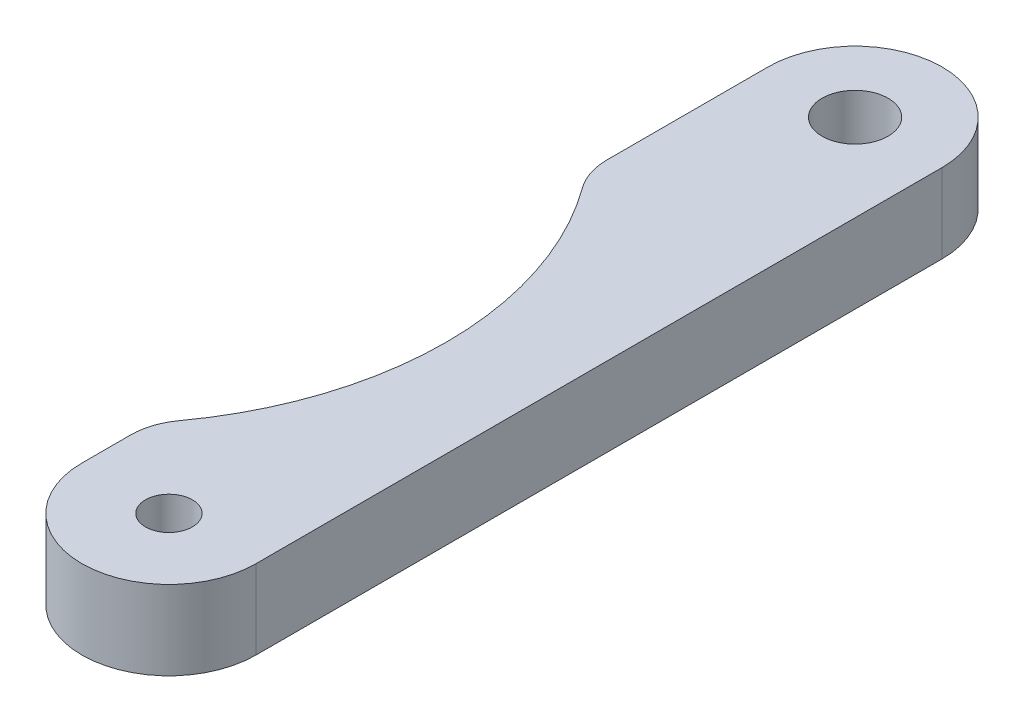
ISO-10303-21;
HEADER;
FILE_DESCRIPTION(('STEP AP214'),'2;1');
FILE_NAME('part.step','',(''),(''),'','','');
FILE_SCHEMA(('AUTOMOTIVE_DESIGN { 1 0 10303 214 1 1 1 1 }'));
ENDSEC;
DATA;
#1=APPLICATION_CONTEXT('core data for automotive mechanical design processes');
#2=APPLICATION_PROTOCOL_DEFINITION('international standard','automotive_design',2000,#1);
#3=PRODUCT_CONTEXT('',#1,'mechanical');
#4=PRODUCT('Part','Part','',(#3));
#5=PRODUCT_RELATED_PRODUCT_CATEGORY('part','',(#4));
#6=PRODUCT_DEFINITION_FORMATION('','',#4);
#7=PRODUCT_DEFINITION_CONTEXT('part definition',#1,'design');
#8=PRODUCT_DEFINITION('design','',#6,#7);
#9=PRODUCT_DEFINITION_SHAPE('','',#8);
#10=(LENGTH_UNIT() NAMED_UNIT(*) SI_UNIT(.MILLI.,.METRE.));
#11=(NAMED_UNIT(*) PLANE_ANGLE_UNIT() SI_UNIT($,.RADIAN.));
#12=(NAMED_UNIT(*) SI_UNIT($,.STERADIAN.) SOLID_ANGLE_UNIT());
#13=UNCERTAINTY_MEASURE_WITH_UNIT(LENGTH_MEASURE(1.E-05),#10,'distance_accuracy_value','');
#14=(GEOMETRIC_REPRESENTATION_CONTEXT(3) GLOBAL_UNCERTAINTY_ASSIGNED_CONTEXT((#13)) GLOBAL_UNIT_ASSIGNED_CONTEXT((#10,
#11,#12)) REPRESENTATION_CONTEXT('',''));
#15=CARTESIAN_POINT('',(0.,0.,0.));
#16=DIRECTION('',(0.,0.,1.));
#17=DIRECTION('',(1.,0.,0.));
#18=AXIS2_PLACEMENT_3D('',#15,#16,#17);
#19=CARTESIAN_POINT('',(0.30765517241379,3.81,-6.51724137931036));
#20=DIRECTION('',(1.,0.,0.));
#21=DIRECTION('',(0.,0.,-1.));
#22=AXIS2_PLACEMENT_3D('',#19,#20,#21);
#23=PLANE('',#22);
#24=DIRECTION('',(0.,0.,1.));
#25=VECTOR('',#24,1.);
#26=CARTESIAN_POINT('',(0.30765517241379,3.81,-6.51724137931036));
#27=LINE('',#26,#25);
#28=CARTESIAN_POINT('',(0.307655172413794,3.81,24.1582715009935));
#29=VERTEX_POINT('',#28);
#30=CARTESIAN_POINT('',(0.307655172413794,3.81,26.5027586206896));
#31=VERTEX_POINT('',#30);
#32=EDGE_CURVE('E114',#29,#31,#27,.T.);
#33=ORIENTED_EDGE('',*,*,#32,.F.);
#34=DIRECTION('',(0.,1.,0.));
#35=VECTOR('',#34,1.);
#36=CARTESIAN_POINT('',(0.307655172413794,0.,24.1582715009935));
#37=LINE('',#36,#35);
#38=CARTESIAN_POINT('',(0.307655172413794,0.,24.1582715009935));
#39=VERTEX_POINT('',#38);
#40=EDGE_CURVE('E62',#29,#39,#37,.F.);
#41=ORIENTED_EDGE('',*,*,#40,.T.);
#42=DIRECTION('',(0.,0.,1.));
#43=VECTOR('',#42,1.);
#44=CARTESIAN_POINT('',(0.30765517241379,0.,-6.51724137931036));
#45=LINE('',#44,#43);
#46=CARTESIAN_POINT('',(0.307655172413794,0.,26.5027586206896));
#47=VERTEX_POINT('',#46);
#48=EDGE_CURVE('E155',#39,#47,#45,.T.);
#49=ORIENTED_EDGE('',*,*,#48,.T.);
#50=DIRECTION('',(0.,-1.,0.));
#51=VECTOR('',#50,1.);
#52=CARTESIAN_POINT('',(0.307655172413794,3.81,26.5027586206896));
#53=LINE('',#52,#51);
#54=EDGE_CURVE('E132',#31,#47,#53,.T.);
#55=ORIENTED_EDGE('',*,*,#54,.F.);
#56=EDGE_LOOP('',(#33,#41,#49,#55));
#57=FACE_BOUND('',#56,.T.);
#58=ADVANCED_FACE('F39',(#57),#23,.F.);
#59=CARTESIAN_POINT('',(0.30765517241379,0.,-6.51724137931036));
#60=VERTEX_POINT('',#59);
#61=CARTESIAN_POINT('',(0.307655172413791,0.,1.22176292136022));
#62=VERTEX_POINT('',#61);
#63=EDGE_CURVE('E173',#60,#62,#45,.T.);
#64=ORIENTED_EDGE('',*,*,#63,.T.);
#65=DIRECTION('',(0.,1.,0.));
#66=VECTOR('',#65,1.);
#67=CARTESIAN_POINT('',(0.307655172413791,3.81,1.22176292136022));
#68=LINE('',#67,#66);
#69=CARTESIAN_POINT('',(0.307655172413791,3.81,1.22176292136022));
#70=VERTEX_POINT('',#69);
#71=EDGE_CURVE('E11',#62,#70,#68,.T.);
#72=ORIENTED_EDGE('',*,*,#71,.T.);
#73=CARTESIAN_POINT('',(0.30765517241379,3.81,-6.51724137931036));
#74=VERTEX_POINT('',#73);
#75=EDGE_CURVE('E104',#74,#70,#27,.T.);
#76=ORIENTED_EDGE('',*,*,#75,.F.);
#77=DIRECTION('',(0.,-1.,0.));
#78=VECTOR('',#77,1.);
#79=CARTESIAN_POINT('',(0.30765517241379,3.81,-6.51724137931036));
#80=LINE('',#79,#78);
#81=EDGE_CURVE('E108',#74,#60,#80,.T.);
#82=ORIENTED_EDGE('',*,*,#81,.T.);
#83=EDGE_LOOP('',(#64,#72,#76,#82));
#84=FACE_BOUND('',#83,.T.);
#85=ADVANCED_FACE('F106',(#84),#23,.F.);
#86=CARTESIAN_POINT('',(4.49865517241379,3.81,-6.51724137931036));
#87=DIRECTION('',(0.,-1.,0.));
#88=DIRECTION('',(0.,0.,-1.));
#89=AXIS2_PLACEMENT_3D('',#86,#87,#88);
#90=CYLINDRICAL_SURFACE('',#89,4.191);
#91=CARTESIAN_POINT('',(4.49865517241379,0.,-6.51724137931036));
#92=DIRECTION('',(0.,1.,0.));
#93=DIRECTION('',(0.,0.,-1.));
#94=AXIS2_PLACEMENT_3D('',#91,#92,#93);
#95=CIRCLE('',#94,4.191);
#96=CARTESIAN_POINT('',(8.68965517241379,0.,-6.51724137931035));
#97=VERTEX_POINT('',#96);
#98=EDGE_CURVE('E130',#97,#60,#95,.T.);
#99=ORIENTED_EDGE('',*,*,#98,.T.);
#100=ORIENTED_EDGE('',*,*,#81,.F.);
#101=CARTESIAN_POINT('',(4.49865517241379,3.81,-6.51724137931036));
#102=DIRECTION('',(0.,1.,0.));
#103=DIRECTION('',(0.,0.,-1.));
#104=AXIS2_PLACEMENT_3D('',#101,#102,#103);
#105=CIRCLE('',#104,4.191);
#106=CARTESIAN_POINT('',(8.68965517241379,3.81,-6.51724137931035));
#107=VERTEX_POINT('',#106);
#108=EDGE_CURVE('E117',#107,#74,#105,.T.);
#109=ORIENTED_EDGE('',*,*,#108,.F.);
#110=DIRECTION('',(0.,-1.,0.));
#111=VECTOR('',#110,1.);
#112=CARTESIAN_POINT('',(8.68965517241379,3.81,-6.51724137931035));
#113=LINE('',#112,#111);
#114=EDGE_CURVE('E170',#107,#97,#113,.T.);
#115=ORIENTED_EDGE('',*,*,#114,.T.);
#116=EDGE_LOOP('',(#99,#100,#109,#115));
#117=FACE_BOUND('',#116,.T.);
#118=ADVANCED_FACE('F128',(#117),#90,.T.);
#119=CARTESIAN_POINT('',(4.49865517241379,3.81,26.5027586206896));
#120=DIRECTION('',(0.,-1.,0.));
#121=DIRECTION('',(0.,0.,-1.));
#122=AXIS2_PLACEMENT_3D('',#119,#120,#121);
#123=CYLINDRICAL_SURFACE('',#122,4.191);
#124=CARTESIAN_POINT('',(4.49865517241379,0.,26.5027586206896));
#125=DIRECTION('',(0.,1.,0.));
#126=DIRECTION('',(0.,0.,-1.));
#127=AXIS2_PLACEMENT_3D('',#124,#125,#126);
#128=CIRCLE('',#127,4.191);
#129=CARTESIAN_POINT('',(8.6896551724138,0.,26.5027586206896));
#130=VERTEX_POINT('',#129);
#131=EDGE_CURVE('E175',#47,#130,#128,.T.);
#132=ORIENTED_EDGE('',*,*,#131,.T.);
#133=DIRECTION('',(0.,-1.,0.));
#134=VECTOR('',#133,1.);
#135=CARTESIAN_POINT('',(8.6896551724138,3.81,26.5027586206896));
#136=LINE('',#135,#134);
#137=CARTESIAN_POINT('',(8.6896551724138,3.81,26.5027586206896));
#138=VERTEX_POINT('',#137);
#139=EDGE_CURVE('E137',#138,#130,#136,.T.);
#140=ORIENTED_EDGE('',*,*,#139,.F.);
#141=CARTESIAN_POINT('',(4.49865517241379,3.81,26.5027586206896));
#142=DIRECTION('',(0.,1.,0.));
#143=DIRECTION('',(0.,0.,-1.));
#144=AXIS2_PLACEMENT_3D('',#141,#142,#143);
#145=CIRCLE('',#144,4.191);
#146=EDGE_CURVE('E113',#31,#138,#145,.T.);
#147=ORIENTED_EDGE('',*,*,#146,.F.);
#148=ORIENTED_EDGE('',*,*,#54,.T.);
#149=EDGE_LOOP('',(#132,#140,#147,#148));
#150=FACE_BOUND('',#149,.T.);
#151=ADVANCED_FACE('F212',(#150),#123,.T.);
#152=CARTESIAN_POINT('',(8.68965517241379,3.81,-6.51724137931035));
#153=DIRECTION('',(-1.,0.,0.));
#154=DIRECTION('',(0.,0.,1.));
#155=AXIS2_PLACEMENT_3D('',#152,#153,#154);
#156=PLANE('',#155);
#157=DIRECTION('',(0.,0.,-1.));
#158=VECTOR('',#157,1.);
#159=CARTESIAN_POINT('',(8.68965517241379,0.,-6.51724137931035));
#160=LINE('',#159,#158);
#161=EDGE_CURVE('E126',#130,#97,#160,.T.);
#162=ORIENTED_EDGE('',*,*,#161,.T.);
#163=ORIENTED_EDGE('',*,*,#114,.F.);
#164=DIRECTION('',(0.,0.,-1.));
#165=VECTOR('',#164,1.);
#166=CARTESIAN_POINT('',(8.68965517241379,3.81,-6.51724137931035));
#167=LINE('',#166,#165);
#168=EDGE_CURVE('E122',#138,#107,#167,.T.);
#169=ORIENTED_EDGE('',*,*,#168,.F.);
#170=ORIENTED_EDGE('',*,*,#139,.T.);
#171=EDGE_LOOP('',(#162,#163,#169,#170));
#172=FACE_BOUND('',#171,.T.);
#173=ADVANCED_FACE('F182',(#172),#156,.F.);
#174=CARTESIAN_POINT('',(4.49865517241379,3.81,-6.51724137931036));
#175=DIRECTION('',(0.,-1.,0.));
#176=DIRECTION('',(0.,0.,-1.));
#177=AXIS2_PLACEMENT_3D('',#174,#175,#176);
#178=PLANE('',#177);
#179=CARTESIAN_POINT('',(4.49865517241379,3.81,-6.51724137931035));
#180=DIRECTION('',(0.,1.,0.));
#181=DIRECTION('',(0.,0.,1.));
#182=AXIS2_PLACEMENT_3D('',#179,#180,#181);
#183=CIRCLE('',#182,1.5875);
#184=CARTESIAN_POINT('',(4.49865517241379,3.81,-4.92974137931035));
#185=VERTEX_POINT('',#184);
#186=EDGE_CURVE('E191',#185,#185,#183,.T.);
#187=ORIENTED_EDGE('',*,*,#186,.F.);
#188=EDGE_LOOP('',(#187));
#189=FACE_BOUND('',#188,.T.);
#190=CARTESIAN_POINT('',(-12.4511278879657,3.81,12.6900172111769));
#191=DIRECTION('',(0.,1.,0.));
#192=DIRECTION('',(0.,0.,1.));
#193=AXIS2_PLACEMENT_3D('',#190,#191,#192);
#194=CIRCLE('',#193,16.49);
#195=CARTESIAN_POINT('',(0.881983074869492,3.81,22.3930194297031));
#196=VERTEX_POINT('',#195);
#197=CARTESIAN_POINT('',(0.881983074869492,3.81,2.98701499265062));
#198=VERTEX_POINT('',#197);
#199=EDGE_CURVE('E164',#196,#198,#194,.T.);
#200=ORIENTED_EDGE('',*,*,#199,.F.);
#201=CARTESIAN_POINT('',(3.30765517241379,3.81,24.1582715009935));
#202=DIRECTION('',(0.,-1.,0.));
#203=DIRECTION('',(0.,0.,-1.));
#204=AXIS2_PLACEMENT_3D('',#201,#202,#203);
#205=CIRCLE('',#204,3.);
#206=EDGE_CURVE('E148',#196,#29,#205,.F.);
#207=ORIENTED_EDGE('',*,*,#206,.T.);
#208=ORIENTED_EDGE('',*,*,#32,.T.);
#209=ORIENTED_EDGE('',*,*,#146,.T.);
#210=ORIENTED_EDGE('',*,*,#168,.T.);
#211=ORIENTED_EDGE('',*,*,#108,.T.);
#212=ORIENTED_EDGE('',*,*,#75,.T.);
#213=CARTESIAN_POINT('',(3.30765517241379,3.81,1.22176292136022));
#214=DIRECTION('',(0.,-1.,0.));
#215=DIRECTION('',(0.,0.,-1.));
#216=AXIS2_PLACEMENT_3D('',#213,#214,#215);
#217=CIRCLE('',#216,3.);
#218=EDGE_CURVE('E146',#70,#198,#217,.F.);
#219=ORIENTED_EDGE('',*,*,#218,.T.);
#220=EDGE_LOOP('',(#200,#207,#208,#209,#210,#211,#212,#219));
#221=FACE_BOUND('',#220,.T.);
#222=CARTESIAN_POINT('',(4.49865517241379,3.81,26.5027586206896));
#223=DIRECTION('',(0.,1.,0.));
#224=DIRECTION('',(0.,0.,1.));
#225=AXIS2_PLACEMENT_3D('',#222,#223,#224);
#226=CIRCLE('',#225,1.1303);
#227=CARTESIAN_POINT('',(4.49865517241379,3.81,27.6330586206896));
#228=VERTEX_POINT('',#227);
#229=EDGE_CURVE('E185',#228,#228,#226,.T.);
#230=ORIENTED_EDGE('',*,*,#229,.F.);
#231=EDGE_LOOP('',(#230));
#232=FACE_BOUND('',#231,.T.);
#233=ADVANCED_FACE('F119',(#189,#221,#232),#178,.F.);
#234=CARTESIAN_POINT('',(4.49865517241379,0.,-6.51724137931036));
#235=DIRECTION('',(0.,-1.,0.));
#236=DIRECTION('',(0.,0.,-1.));
#237=AXIS2_PLACEMENT_3D('',#234,#235,#236);
#238=PLANE('',#237);
#239=CARTESIAN_POINT('',(4.49865517241379,0.,-6.51724137931035));
#240=DIRECTION('',(0.,1.,0.));
#241=DIRECTION('',(0.,0.,1.));
#242=AXIS2_PLACEMENT_3D('',#239,#240,#241);
#243=CIRCLE('',#242,1.5875);
#244=CARTESIAN_POINT('',(4.49865517241379,0.,-4.92974137931035));
#245=VERTEX_POINT('',#244);
#246=EDGE_CURVE('E186',#245,#245,#243,.T.);
#247=ORIENTED_EDGE('',*,*,#246,.T.);
#248=EDGE_LOOP('',(#247));
#249=FACE_BOUND('',#248,.T.);
#250=CARTESIAN_POINT('',(4.49865517241379,0.,26.5027586206896));
#251=DIRECTION('',(0.,1.,0.));
#252=DIRECTION('',(0.,0.,1.));
#253=AXIS2_PLACEMENT_3D('',#250,#251,#252);
#254=CIRCLE('',#253,1.1303);
#255=CARTESIAN_POINT('',(4.49865517241379,0.,27.6330586206896));
#256=VERTEX_POINT('',#255);
#257=EDGE_CURVE('E172',#256,#256,#254,.T.);
#258=ORIENTED_EDGE('',*,*,#257,.T.);
#259=EDGE_LOOP('',(#258));
#260=FACE_BOUND('',#259,.T.);
#261=ORIENTED_EDGE('',*,*,#48,.F.);
#262=CARTESIAN_POINT('',(3.30765517241379,0.,24.1582715009935));
#263=DIRECTION('',(0.,-1.,0.));
#264=DIRECTION('',(0.,0.,-1.));
#265=AXIS2_PLACEMENT_3D('',#262,#263,#264);
#266=CIRCLE('',#265,3.);
#267=CARTESIAN_POINT('',(0.881983074869492,0.,22.3930194297031));
#268=VERTEX_POINT('',#267);
#269=EDGE_CURVE('E47',#39,#268,#266,.T.);
#270=ORIENTED_EDGE('',*,*,#269,.T.);
#271=CARTESIAN_POINT('',(-12.4511278879657,0.,12.6900172111769));
#272=DIRECTION('',(0.,-1.,0.));
#273=DIRECTION('',(0.,0.,-1.));
#274=AXIS2_PLACEMENT_3D('',#271,#272,#273);
#275=CIRCLE('',#274,16.49);
#276=CARTESIAN_POINT('',(0.881983074869492,0.,2.98701499265062));
#277=VERTEX_POINT('',#276);
#278=EDGE_CURVE('E131',#268,#277,#275,.F.);
#279=ORIENTED_EDGE('',*,*,#278,.T.);
#280=CARTESIAN_POINT('',(3.30765517241379,0.,1.22176292136022));
#281=DIRECTION('',(0.,-1.,0.));
#282=DIRECTION('',(0.,0.,-1.));
#283=AXIS2_PLACEMENT_3D('',#280,#281,#282);
#284=CIRCLE('',#283,3.);
#285=EDGE_CURVE('E54',#277,#62,#284,.T.);
#286=ORIENTED_EDGE('',*,*,#285,.T.);
#287=ORIENTED_EDGE('',*,*,#63,.F.);
#288=ORIENTED_EDGE('',*,*,#98,.F.);
#289=ORIENTED_EDGE('',*,*,#161,.F.);
#290=ORIENTED_EDGE('',*,*,#131,.F.);
#291=EDGE_LOOP('',(#261,#270,#279,#286,#287,#288,#289,#290));
#292=FACE_BOUND('',#291,.T.);
#293=ADVANCED_FACE('F153',(#249,#260,#292),#238,.T.);
#294=CARTESIAN_POINT('',(4.49865517241379,3.81,26.5027586206896));
#295=DIRECTION('',(0.,1.,0.));
#296=DIRECTION('',(0.,0.,1.));
#297=AXIS2_PLACEMENT_3D('',#294,#295,#296);
#298=CYLINDRICAL_SURFACE('',#297,1.1303);
#299=ORIENTED_EDGE('',*,*,#257,.F.);
#300=EDGE_LOOP('',(#299));
#301=FACE_BOUND('',#300,.T.);
#302=ORIENTED_EDGE('',*,*,#229,.T.);
#303=EDGE_LOOP('',(#302));
#304=FACE_BOUND('',#303,.T.);
#305=ADVANCED_FACE('F198',(#301,#304),#298,.F.);
#306=CARTESIAN_POINT('',(-12.4511278879657,3.81,12.6900172111769));
#307=DIRECTION('',(0.,-1.,0.));
#308=DIRECTION('',(0.,0.,-1.));
#309=AXIS2_PLACEMENT_3D('',#306,#307,#308);
#310=CYLINDRICAL_SURFACE('',#309,16.49);
#311=ORIENTED_EDGE('',*,*,#278,.F.);
#312=DIRECTION('',(0.,-1.,0.));
#313=VECTOR('',#312,1.);
#314=CARTESIAN_POINT('',(0.881983074869492,3.81,22.3930194297031));
#315=LINE('',#314,#313);
#316=EDGE_CURVE('E143',#268,#196,#315,.F.);
#317=ORIENTED_EDGE('',*,*,#316,.T.);
#318=ORIENTED_EDGE('',*,*,#199,.T.);
#319=DIRECTION('',(0.,-1.,0.));
#320=VECTOR('',#319,1.);
#321=CARTESIAN_POINT('',(0.881983074869492,3.81,2.98701499265062));
#322=LINE('',#321,#320);
#323=EDGE_CURVE('E134',#198,#277,#322,.T.);
#324=ORIENTED_EDGE('',*,*,#323,.T.);
#325=EDGE_LOOP('',(#311,#317,#318,#324));
#326=FACE_BOUND('',#325,.T.);
#327=ADVANCED_FACE('F159',(#326),#310,.F.);
#328=CARTESIAN_POINT('',(4.49865517241379,0.,-6.51724137931035));
#329=DIRECTION('',(0.,1.,0.));
#330=DIRECTION('',(0.,0.,1.));
#331=AXIS2_PLACEMENT_3D('',#328,#329,#330);
#332=CYLINDRICAL_SURFACE('',#331,1.5875);
#333=ORIENTED_EDGE('',*,*,#246,.F.);
#334=EDGE_LOOP('',(#333));
#335=FACE_BOUND('',#334,.T.);
#336=ORIENTED_EDGE('',*,*,#186,.T.);
#337=EDGE_LOOP('',(#336));
#338=FACE_BOUND('',#337,.T.);
#339=ADVANCED_FACE('F224',(#335,#338),#332,.F.);
#340=CARTESIAN_POINT('',(3.30765517241379,3.81,24.1582715009935));
#341=DIRECTION('',(0.,-1.,0.));
#342=DIRECTION('',(0.,0.,-1.));
#343=AXIS2_PLACEMENT_3D('',#340,#341,#342);
#344=CYLINDRICAL_SURFACE('',#343,3.);
#345=ORIENTED_EDGE('',*,*,#269,.F.);
#346=ORIENTED_EDGE('',*,*,#40,.F.);
#347=ORIENTED_EDGE('',*,*,#206,.F.);
#348=ORIENTED_EDGE('',*,*,#316,.F.);
#349=EDGE_LOOP('',(#345,#346,#347,#348));
#350=FACE_BOUND('',#349,.T.);
#351=ADVANCED_FACE('F162',(#350),#344,.T.);
#352=CARTESIAN_POINT('',(3.30765517241379,3.81,1.22176292136022));
#353=DIRECTION('',(0.,-1.,0.));
#354=DIRECTION('',(0.,0.,-1.));
#355=AXIS2_PLACEMENT_3D('',#352,#353,#354);
#356=CYLINDRICAL_SURFACE('',#355,3.);
#357=ORIENTED_EDGE('',*,*,#218,.F.);
#358=ORIENTED_EDGE('',*,*,#71,.F.);
#359=ORIENTED_EDGE('',*,*,#285,.F.);
#360=ORIENTED_EDGE('',*,*,#323,.F.);
#361=EDGE_LOOP('',(#357,#358,#359,#360));
#362=FACE_BOUND('',#361,.T.);
#363=ADVANCED_FACE('F41',(#362),#356,.T.);
#364=CLOSED_SHELL('',(#58,#85,#118,#151,#173,#233,#293,#305,#327,#339,#351,#363));
#365=MANIFOLD_SOLID_BREP('B2',#364);
#366=ADVANCED_BREP_SHAPE_REPRESENTATION('',(#18,#365),#14);
#367=SHAPE_DEFINITION_REPRESENTATION(#9,#366);
ENDSEC;
END-ISO-10303-21;
